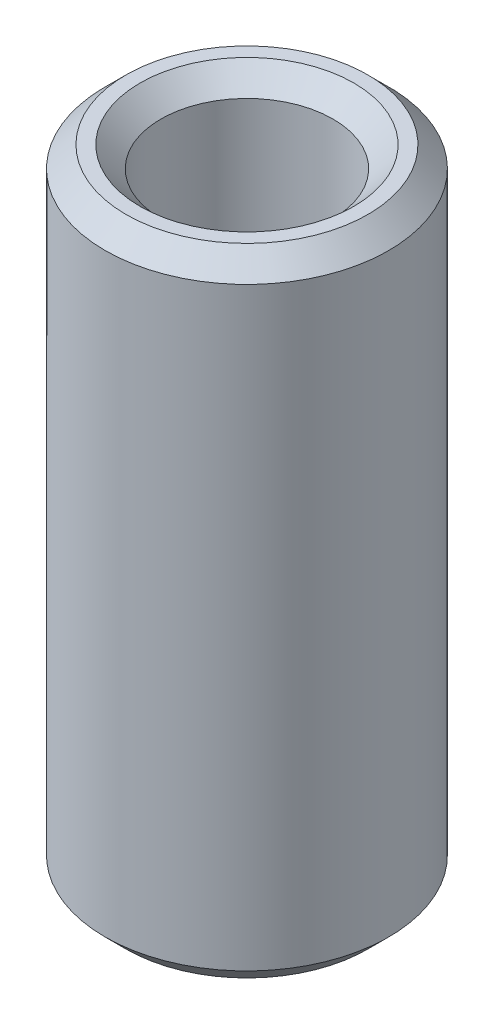
ISO-10303-21;
HEADER;
FILE_DESCRIPTION(('STEP AP214'),'2;1');
FILE_NAME('part.step','',(''),(''),'','','');
FILE_SCHEMA(('AUTOMOTIVE_DESIGN { 1 0 10303 214 1 1 1 1 }'));
ENDSEC;
DATA;
#1=APPLICATION_CONTEXT('core data for automotive mechanical design processes');
#2=APPLICATION_PROTOCOL_DEFINITION('international standard','automotive_design',2000,#1);
#3=PRODUCT_CONTEXT('',#1,'mechanical');
#4=PRODUCT('Part','Part','',(#3));
#5=PRODUCT_RELATED_PRODUCT_CATEGORY('part','',(#4));
#6=PRODUCT_DEFINITION_FORMATION('','',#4);
#7=PRODUCT_DEFINITION_CONTEXT('part definition',#1,'design');
#8=PRODUCT_DEFINITION('design','',#6,#7);
#9=PRODUCT_DEFINITION_SHAPE('','',#8);
#10=(LENGTH_UNIT() NAMED_UNIT(*) SI_UNIT(.MILLI.,.METRE.));
#11=(NAMED_UNIT(*) PLANE_ANGLE_UNIT() SI_UNIT($,.RADIAN.));
#12=(NAMED_UNIT(*) SI_UNIT($,.STERADIAN.) SOLID_ANGLE_UNIT());
#13=UNCERTAINTY_MEASURE_WITH_UNIT(LENGTH_MEASURE(1.E-05),#10,'distance_accuracy_value','');
#14=(GEOMETRIC_REPRESENTATION_CONTEXT(3) GLOBAL_UNCERTAINTY_ASSIGNED_CONTEXT((#13)) GLOBAL_UNIT_ASSIGNED_CONTEXT((#10,
#11,#12)) REPRESENTATION_CONTEXT('',''));
#15=CARTESIAN_POINT('',(0.,0.,0.));
#16=DIRECTION('',(0.,0.,1.));
#17=DIRECTION('',(1.,0.,0.));
#18=AXIS2_PLACEMENT_3D('',#15,#16,#17);
#19=CARTESIAN_POINT('',(0.,89.7537471500467,0.));
#20=DIRECTION('',(0.,-1.,0.));
#21=DIRECTION('',(0.,0.,-1.));
#22=AXIS2_PLACEMENT_3D('',#19,#20,#21);
#23=CYLINDRICAL_SURFACE('',#22,20.);
#24=CARTESIAN_POINT('',(0.,2.93588324519964,0.));
#25=DIRECTION('',(0.,1.,0.));
#26=DIRECTION('',(0.,0.,1.));
#27=AXIS2_PLACEMENT_3D('',#24,#25,#26);
#28=CIRCLE('',#27,20.);
#29=CARTESIAN_POINT('',(0.,2.93588324519964,20.));
#30=VERTEX_POINT('',#29);
#31=EDGE_CURVE('E10',#30,#30,#28,.T.);
#32=ORIENTED_EDGE('',*,*,#31,.T.);
#33=EDGE_LOOP('',(#32));
#34=FACE_BOUND('',#33,.T.);
#35=CARTESIAN_POINT('',(0.,86.8178639048471,0.));
#36=DIRECTION('',(0.,1.,0.));
#37=DIRECTION('',(0.,0.,1.));
#38=AXIS2_PLACEMENT_3D('',#35,#36,#37);
#39=CIRCLE('',#38,20.);
#40=CARTESIAN_POINT('',(0.,86.8178639048471,20.));
#41=VERTEX_POINT('',#40);
#42=EDGE_CURVE('E50',#41,#41,#39,.F.);
#43=ORIENTED_EDGE('',*,*,#42,.T.);
#44=EDGE_LOOP('',(#43));
#45=FACE_BOUND('',#44,.T.);
#46=ADVANCED_FACE('F39',(#34,#45),#23,.T.);
#47=CARTESIAN_POINT('',(0.,89.7537471500467,0.));
#48=DIRECTION('',(0.,1.,0.));
#49=DIRECTION('',(0.,0.,1.));
#50=AXIS2_PLACEMENT_3D('',#47,#48,#49);
#51=PLANE('',#50);
#52=CARTESIAN_POINT('',(0.,89.7537471500467,0.));
#53=DIRECTION('',(0.,1.,0.));
#54=DIRECTION('',(0.,0.,1.));
#55=AXIS2_PLACEMENT_3D('',#52,#53,#54);
#56=CIRCLE('',#55,15.0818511099908);
#57=CARTESIAN_POINT('',(0.,89.7537471500467,15.0818511099908));
#58=VERTEX_POINT('',#57);
#59=EDGE_CURVE('E58',#58,#58,#56,.F.);
#60=ORIENTED_EDGE('',*,*,#59,.T.);
#61=EDGE_LOOP('',(#60));
#62=FACE_BOUND('',#61,.T.);
#63=CARTESIAN_POINT('',(0.,89.7537471500467,0.));
#64=DIRECTION('',(0.,1.,0.));
#65=DIRECTION('',(0.,0.,1.));
#66=AXIS2_PLACEMENT_3D('',#63,#64,#65);
#67=CIRCLE('',#66,17.0641167548004);
#68=CARTESIAN_POINT('',(0.,89.7537471500467,17.0641167548004));
#69=VERTEX_POINT('',#68);
#70=EDGE_CURVE('E61',#69,#69,#67,.T.);
#71=ORIENTED_EDGE('',*,*,#70,.T.);
#72=EDGE_LOOP('',(#71));
#73=FACE_BOUND('',#72,.T.);
#74=ADVANCED_FACE('F88',(#62,#73),#51,.T.);
#75=CARTESIAN_POINT('',(0.,0.,0.));
#76=DIRECTION('',(0.,1.,0.));
#77=DIRECTION('',(0.,0.,1.));
#78=AXIS2_PLACEMENT_3D('',#75,#76,#77);
#79=PLANE('',#78);
#80=CARTESIAN_POINT('',(0.,0.,0.));
#81=DIRECTION('',(0.,1.,0.));
#82=DIRECTION('',(0.,0.,1.));
#83=AXIS2_PLACEMENT_3D('',#80,#81,#82);
#84=CIRCLE('',#83,15.0818511099907);
#85=CARTESIAN_POINT('',(0.,0.,15.0818511099907));
#86=VERTEX_POINT('',#85);
#87=EDGE_CURVE('E51',#86,#86,#84,.T.);
#88=ORIENTED_EDGE('',*,*,#87,.T.);
#89=EDGE_LOOP('',(#88));
#90=FACE_BOUND('',#89,.T.);
#91=CARTESIAN_POINT('',(0.,0.,0.));
#92=DIRECTION('',(0.,1.,0.));
#93=DIRECTION('',(0.,0.,1.));
#94=AXIS2_PLACEMENT_3D('',#91,#92,#93);
#95=CIRCLE('',#94,17.0641167548003);
#96=CARTESIAN_POINT('',(0.,0.,17.0641167548003));
#97=VERTEX_POINT('',#96);
#98=EDGE_CURVE('E54',#97,#97,#95,.F.);
#99=ORIENTED_EDGE('',*,*,#98,.T.);
#100=EDGE_LOOP('',(#99));
#101=FACE_BOUND('',#100,.T.);
#102=ADVANCED_FACE('F83',(#90,#101),#79,.F.);
#103=CARTESIAN_POINT('',(0.,89.7537471500467,0.));
#104=DIRECTION('',(0.,-1.,0.));
#105=DIRECTION('',(0.,0.,-1.));
#106=AXIS2_PLACEMENT_3D('',#103,#104,#105);
#107=CYLINDRICAL_SURFACE('',#106,12.1459678647911);
#108=CARTESIAN_POINT('',(0.,86.8178639048471,0.));
#109=DIRECTION('',(0.,1.,0.));
#110=DIRECTION('',(0.,0.,1.));
#111=AXIS2_PLACEMENT_3D('',#108,#109,#110);
#112=CIRCLE('',#111,12.1459678647911);
#113=CARTESIAN_POINT('',(0.,86.8178639048471,12.1459678647911));
#114=VERTEX_POINT('',#113);
#115=EDGE_CURVE('E67',#114,#114,#112,.T.);
#116=ORIENTED_EDGE('',*,*,#115,.T.);
#117=EDGE_LOOP('',(#116));
#118=FACE_BOUND('',#117,.T.);
#119=CARTESIAN_POINT('',(0.,2.93588324519965,0.));
#120=DIRECTION('',(0.,1.,0.));
#121=DIRECTION('',(0.,0.,1.));
#122=AXIS2_PLACEMENT_3D('',#119,#120,#121);
#123=CIRCLE('',#122,12.1459678647911);
#124=CARTESIAN_POINT('',(0.,2.93588324519965,12.1459678647911));
#125=VERTEX_POINT('',#124);
#126=EDGE_CURVE('E69',#125,#125,#123,.F.);
#127=ORIENTED_EDGE('',*,*,#126,.T.);
#128=EDGE_LOOP('',(#127));
#129=FACE_BOUND('',#128,.T.);
#130=ADVANCED_FACE('F71',(#118,#129),#107,.F.);
#131=CARTESIAN_POINT('',(0.,86.8178639048471,0.));
#132=DIRECTION('',(0.,1.,0.));
#133=DIRECTION('',(0.,0.,1.));
#134=AXIS2_PLACEMENT_3D('',#131,#132,#133);
#135=CONICAL_SURFACE('',#134,12.1459678647911,0.785398163397451);
#136=ORIENTED_EDGE('',*,*,#59,.F.);
#137=EDGE_LOOP('',(#136));
#138=FACE_BOUND('',#137,.T.);
#139=ORIENTED_EDGE('',*,*,#115,.F.);
#140=EDGE_LOOP('',(#139));
#141=FACE_BOUND('',#140,.T.);
#142=ADVANCED_FACE('F77',(#138,#141),#135,.F.);
#143=CARTESIAN_POINT('',(0.,0.,0.));
#144=DIRECTION('',(0.,-1.,0.));
#145=DIRECTION('',(0.,0.,-1.));
#146=AXIS2_PLACEMENT_3D('',#143,#144,#145);
#147=CONICAL_SURFACE('',#146,15.0818511099907,0.785398163397444);
#148=ORIENTED_EDGE('',*,*,#126,.F.);
#149=EDGE_LOOP('',(#148));
#150=FACE_BOUND('',#149,.T.);
#151=ORIENTED_EDGE('',*,*,#87,.F.);
#152=EDGE_LOOP('',(#151));
#153=FACE_BOUND('',#152,.T.);
#154=ADVANCED_FACE('F73',(#150,#153),#147,.F.);
#155=CARTESIAN_POINT('',(0.,2.93588324519964,0.));
#156=DIRECTION('',(0.,1.,0.));
#157=DIRECTION('',(0.,0.,1.));
#158=AXIS2_PLACEMENT_3D('',#155,#156,#157);
#159=CONICAL_SURFACE('',#158,20.,0.785398163397451);
#160=ORIENTED_EDGE('',*,*,#98,.F.);
#161=EDGE_LOOP('',(#160));
#162=FACE_BOUND('',#161,.T.);
#163=ORIENTED_EDGE('',*,*,#31,.F.);
#164=EDGE_LOOP('',(#163));
#165=FACE_BOUND('',#164,.T.);
#166=ADVANCED_FACE('F76',(#162,#165),#159,.T.);
#167=CARTESIAN_POINT('',(0.,89.7537471500467,0.));
#168=DIRECTION('',(0.,-1.,0.));
#169=DIRECTION('',(0.,0.,-1.));
#170=AXIS2_PLACEMENT_3D('',#167,#168,#169);
#171=CONICAL_SURFACE('',#170,17.0641167548004,0.785398163397445);
#172=ORIENTED_EDGE('',*,*,#42,.F.);
#173=EDGE_LOOP('',(#172));
#174=FACE_BOUND('',#173,.T.);
#175=ORIENTED_EDGE('',*,*,#70,.F.);
#176=EDGE_LOOP('',(#175));
#177=FACE_BOUND('',#176,.T.);
#178=ADVANCED_FACE('F45',(#174,#177),#171,.T.);
#179=CLOSED_SHELL('',(#46,#74,#102,#130,#142,#154,#166,#178));
#180=MANIFOLD_SOLID_BREP('B2',#179);
#181=ADVANCED_BREP_SHAPE_REPRESENTATION('',(#18,#180),#14);
#182=SHAPE_DEFINITION_REPRESENTATION(#9,#181);
ENDSEC;
END-ISO-10303-21;
